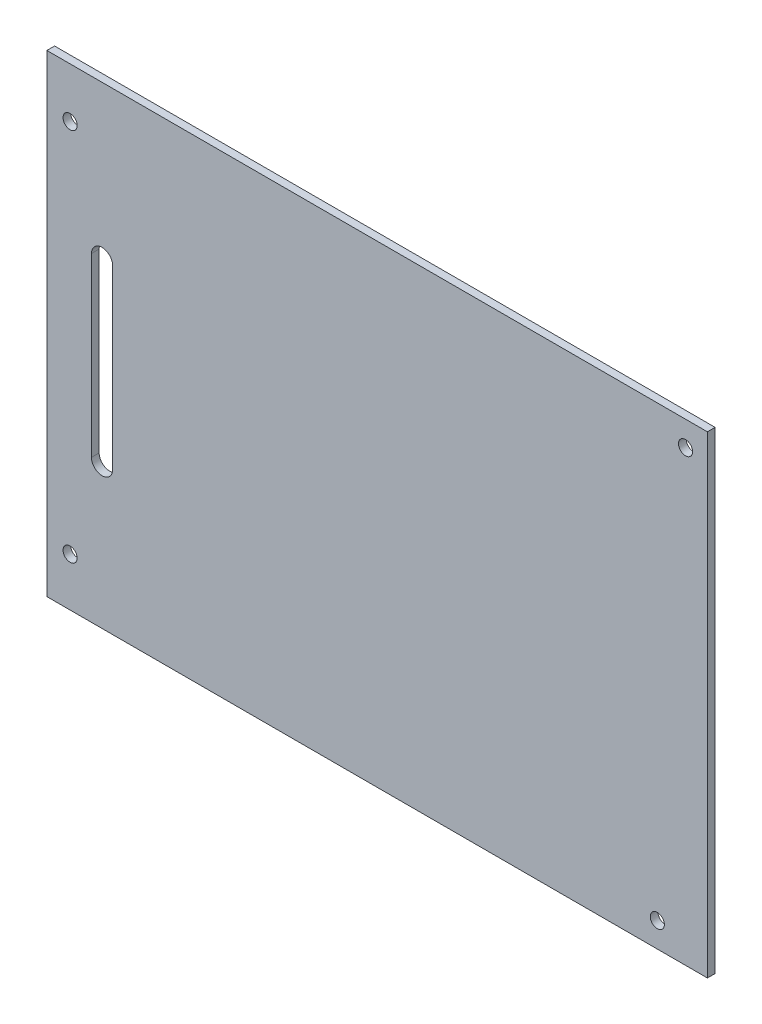
ISO-10303-21;
HEADER;
FILE_DESCRIPTION(('STEP AP214'),'2;1');
FILE_NAME('part.step','',(''),(''),'','','');
FILE_SCHEMA(('AUTOMOTIVE_DESIGN { 1 0 10303 214 1 1 1 1 }'));
ENDSEC;
DATA;
#1=APPLICATION_CONTEXT('core data for automotive mechanical design processes');
#2=APPLICATION_PROTOCOL_DEFINITION('international standard','automotive_design',2000,#1);
#3=PRODUCT_CONTEXT('',#1,'mechanical');
#4=PRODUCT('Part','Part','',(#3));
#5=PRODUCT_RELATED_PRODUCT_CATEGORY('part','',(#4));
#6=PRODUCT_DEFINITION_FORMATION('','',#4);
#7=PRODUCT_DEFINITION_CONTEXT('part definition',#1,'design');
#8=PRODUCT_DEFINITION('design','',#6,#7);
#9=PRODUCT_DEFINITION_SHAPE('','',#8);
#10=(LENGTH_UNIT() NAMED_UNIT(*) SI_UNIT(.MILLI.,.METRE.));
#11=(NAMED_UNIT(*) PLANE_ANGLE_UNIT() SI_UNIT($,.RADIAN.));
#12=(NAMED_UNIT(*) SI_UNIT($,.STERADIAN.) SOLID_ANGLE_UNIT());
#13=UNCERTAINTY_MEASURE_WITH_UNIT(LENGTH_MEASURE(1.E-05),#10,'distance_accuracy_value','');
#14=(GEOMETRIC_REPRESENTATION_CONTEXT(3) GLOBAL_UNCERTAINTY_ASSIGNED_CONTEXT((#13)) GLOBAL_UNIT_ASSIGNED_CONTEXT((#10,
#11,#12)) REPRESENTATION_CONTEXT('',''));
#15=CARTESIAN_POINT('',(0.,0.,0.));
#16=DIRECTION('',(0.,0.,1.));
#17=DIRECTION('',(1.,0.,0.));
#18=AXIS2_PLACEMENT_3D('',#15,#16,#17);
#19=CARTESIAN_POINT('',(102.6585,80.9275,1.09144054));
#20=DIRECTION('',(0.,0.,-1.));
#21=DIRECTION('',(0.,-1.,0.));
#22=AXIS2_PLACEMENT_3D('',#19,#20,#21);
#23=PLANE('',#22);
#24=CARTESIAN_POINT('',(146.336,110.928,1.09144054));
#25=DIRECTION('',(0.,0.,1.));
#26=DIRECTION('',(1.,0.,0.));
#27=AXIS2_PLACEMENT_3D('',#24,#25,#26);
#28=CIRCLE('',#27,1.);
#29=CARTESIAN_POINT('',(147.336,110.928,1.09144054));
#30=VERTEX_POINT('',#29);
#31=EDGE_CURVE('E26',#30,#30,#28,.T.);
#32=ORIENTED_EDGE('',*,*,#31,.F.);
#33=EDGE_LOOP('',(#32));
#34=FACE_BOUND('',#33,.T.);
#35=CARTESIAN_POINT('',(63.6999996,92.67500134,1.09144054));
#36=DIRECTION('',(0.,0.,1.));
#37=DIRECTION('',(1.,0.,0.));
#38=AXIS2_PLACEMENT_3D('',#35,#36,#37);
#39=CIRCLE('',#38,1.49999954);
#40=CARTESIAN_POINT('',(65.19999914,92.67500134,1.09144054));
#41=VERTEX_POINT('',#40);
#42=CARTESIAN_POINT('',(62.20000006,92.67500134,1.09144054));
#43=VERTEX_POINT('',#42);
#44=EDGE_CURVE('E48',#41,#43,#39,.T.);
#45=ORIENTED_EDGE('',*,*,#44,.F.);
#46=DIRECTION('',(0.,1.,0.));
#47=VECTOR('',#46,1.);
#48=CARTESIAN_POINT('',(65.19999914,67.67500054,1.09144054));
#49=LINE('',#48,#47);
#50=CARTESIAN_POINT('',(65.19999914,67.67500054,1.09144054));
#51=VERTEX_POINT('',#50);
#52=EDGE_CURVE('E186',#51,#41,#49,.T.);
#53=ORIENTED_EDGE('',*,*,#52,.F.);
#54=CARTESIAN_POINT('',(63.6999996,67.67500054,1.09144054));
#55=DIRECTION('',(0.,0.,1.));
#56=DIRECTION('',(-1.,0.,0.));
#57=AXIS2_PLACEMENT_3D('',#54,#55,#56);
#58=CIRCLE('',#57,1.49999954);
#59=CARTESIAN_POINT('',(62.20000006,67.67500054,1.09144054));
#60=VERTEX_POINT('',#59);
#61=EDGE_CURVE('E210',#60,#51,#58,.T.);
#62=ORIENTED_EDGE('',*,*,#61,.F.);
#63=DIRECTION('',(0.,-1.,0.));
#64=VECTOR('',#63,1.);
#65=CARTESIAN_POINT('',(62.20000006,92.67500134,1.09144054));
#66=LINE('',#65,#64);
#67=EDGE_CURVE('E198',#43,#60,#66,.T.);
#68=ORIENTED_EDGE('',*,*,#67,.F.);
#69=EDGE_LOOP('',(#45,#53,#62,#68));
#70=FACE_BOUND('',#69,.T.);
#71=CARTESIAN_POINT('',(142.336,50.928,1.09144054));
#72=DIRECTION('',(0.,0.,1.));
#73=DIRECTION('',(1.,0.,0.));
#74=AXIS2_PLACEMENT_3D('',#71,#72,#73);
#75=CIRCLE('',#74,1.);
#76=CARTESIAN_POINT('',(143.336,50.928,1.09144054));
#77=VERTEX_POINT('',#76);
#78=EDGE_CURVE('E182',#77,#77,#75,.T.);
#79=ORIENTED_EDGE('',*,*,#78,.F.);
#80=EDGE_LOOP('',(#79));
#81=FACE_BOUND('',#80,.T.);
#82=CARTESIAN_POINT('',(59.175,107.337,1.09144054));
#83=DIRECTION('',(0.,0.,1.));
#84=DIRECTION('',(1.,0.,0.));
#85=AXIS2_PLACEMENT_3D('',#82,#83,#84);
#86=CIRCLE('',#85,1.);
#87=CARTESIAN_POINT('',(60.175,107.337,1.09144054));
#88=VERTEX_POINT('',#87);
#89=EDGE_CURVE('E174',#88,#88,#86,.T.);
#90=ORIENTED_EDGE('',*,*,#89,.F.);
#91=EDGE_LOOP('',(#90));
#92=FACE_BOUND('',#91,.T.);
#93=CARTESIAN_POINT('',(59.174,54.289,1.09144054));
#94=DIRECTION('',(0.,0.,1.));
#95=DIRECTION('',(1.,0.,0.));
#96=AXIS2_PLACEMENT_3D('',#93,#94,#95);
#97=CIRCLE('',#96,1.);
#98=CARTESIAN_POINT('',(60.174,54.289,1.09144054));
#99=VERTEX_POINT('',#98);
#100=EDGE_CURVE('E117',#99,#99,#97,.T.);
#101=ORIENTED_EDGE('',*,*,#100,.F.);
#102=EDGE_LOOP('',(#101));
#103=FACE_BOUND('',#102,.T.);
#104=DIRECTION('',(-1.,0.,0.));
#105=VECTOR('',#104,1.);
#106=CARTESIAN_POINT('',(149.431,47.432,1.09144054));
#107=LINE('',#106,#105);
#108=CARTESIAN_POINT('',(149.431,47.432,1.09144054));
#109=VERTEX_POINT('',#108);
#110=CARTESIAN_POINT('',(55.886,47.432,1.09144054));
#111=VERTEX_POINT('',#110);
#112=EDGE_CURVE('E118',#109,#111,#107,.T.);
#113=ORIENTED_EDGE('',*,*,#112,.F.);
#114=DIRECTION('',(0.,-1.,0.));
#115=VECTOR('',#114,1.);
#116=CARTESIAN_POINT('',(149.431,114.423,1.09144054));
#117=LINE('',#116,#115);
#118=CARTESIAN_POINT('',(149.431,114.423,1.09144054));
#119=VERTEX_POINT('',#118);
#120=EDGE_CURVE('E143',#119,#109,#117,.T.);
#121=ORIENTED_EDGE('',*,*,#120,.F.);
#122=DIRECTION('',(1.,0.,0.));
#123=VECTOR('',#122,1.);
#124=CARTESIAN_POINT('',(55.886,114.423,1.09144054));
#125=LINE('',#124,#123);
#126=CARTESIAN_POINT('',(55.886,114.423,1.09144054));
#127=VERTEX_POINT('',#126);
#128=EDGE_CURVE('E128',#127,#119,#125,.T.);
#129=ORIENTED_EDGE('',*,*,#128,.F.);
#130=DIRECTION('',(0.,1.,0.));
#131=VECTOR('',#130,1.);
#132=CARTESIAN_POINT('',(55.886,47.432,1.09144054));
#133=LINE('',#132,#131);
#134=EDGE_CURVE('E133',#111,#127,#133,.T.);
#135=ORIENTED_EDGE('',*,*,#134,.F.);
#136=EDGE_LOOP('',(#113,#121,#129,#135));
#137=FACE_BOUND('',#136,.T.);
#138=ADVANCED_FACE('F17',(#34,#70,#81,#92,#103,#137),#23,.F.);
#139=CARTESIAN_POINT('',(102.6585,80.9275,0.));
#140=DIRECTION('',(0.,0.,-1.));
#141=DIRECTION('',(0.,-1.,0.));
#142=AXIS2_PLACEMENT_3D('',#139,#140,#141);
#143=PLANE('',#142);
#144=CARTESIAN_POINT('',(146.336,110.928,0.));
#145=DIRECTION('',(0.,0.,1.));
#146=DIRECTION('',(1.,0.,0.));
#147=AXIS2_PLACEMENT_3D('',#144,#145,#146);
#148=CIRCLE('',#147,1.);
#149=CARTESIAN_POINT('',(147.336,110.928,0.));
#150=VERTEX_POINT('',#149);
#151=EDGE_CURVE('E11',#150,#150,#148,.T.);
#152=ORIENTED_EDGE('',*,*,#151,.T.);
#153=EDGE_LOOP('',(#152));
#154=FACE_BOUND('',#153,.T.);
#155=DIRECTION('',(0.,-1.,0.));
#156=VECTOR('',#155,1.);
#157=CARTESIAN_POINT('',(62.20000006,92.67500134,0.));
#158=LINE('',#157,#156);
#159=CARTESIAN_POINT('',(62.20000006,92.67500134,0.));
#160=VERTEX_POINT('',#159);
#161=CARTESIAN_POINT('',(62.20000006,67.67500054,0.));
#162=VERTEX_POINT('',#161);
#163=EDGE_CURVE('E206',#160,#162,#158,.T.);
#164=ORIENTED_EDGE('',*,*,#163,.T.);
#165=CARTESIAN_POINT('',(63.6999996,67.67500054,0.));
#166=DIRECTION('',(0.,0.,1.));
#167=DIRECTION('',(-1.,0.,0.));
#168=AXIS2_PLACEMENT_3D('',#165,#166,#167);
#169=CIRCLE('',#168,1.49999954);
#170=CARTESIAN_POINT('',(65.19999914,67.67500054,0.));
#171=VERTEX_POINT('',#170);
#172=EDGE_CURVE('E218',#162,#171,#169,.T.);
#173=ORIENTED_EDGE('',*,*,#172,.T.);
#174=DIRECTION('',(0.,1.,0.));
#175=VECTOR('',#174,1.);
#176=CARTESIAN_POINT('',(65.19999914,67.67500054,0.));
#177=LINE('',#176,#175);
#178=CARTESIAN_POINT('',(65.19999914,92.67500134,0.));
#179=VERTEX_POINT('',#178);
#180=EDGE_CURVE('E165',#171,#179,#177,.T.);
#181=ORIENTED_EDGE('',*,*,#180,.T.);
#182=CARTESIAN_POINT('',(63.6999996,92.67500134,0.));
#183=DIRECTION('',(0.,0.,1.));
#184=DIRECTION('',(1.,0.,0.));
#185=AXIS2_PLACEMENT_3D('',#182,#183,#184);
#186=CIRCLE('',#185,1.49999954);
#187=EDGE_CURVE('E38',#179,#160,#186,.T.);
#188=ORIENTED_EDGE('',*,*,#187,.T.);
#189=EDGE_LOOP('',(#164,#173,#181,#188));
#190=FACE_BOUND('',#189,.T.);
#191=CARTESIAN_POINT('',(142.336,50.928,0.));
#192=DIRECTION('',(0.,0.,1.));
#193=DIRECTION('',(1.,0.,0.));
#194=AXIS2_PLACEMENT_3D('',#191,#192,#193);
#195=CIRCLE('',#194,1.);
#196=CARTESIAN_POINT('',(143.336,50.928,0.));
#197=VERTEX_POINT('',#196);
#198=EDGE_CURVE('E190',#197,#197,#195,.T.);
#199=ORIENTED_EDGE('',*,*,#198,.T.);
#200=EDGE_LOOP('',(#199));
#201=FACE_BOUND('',#200,.T.);
#202=CARTESIAN_POINT('',(59.175,107.337,0.));
#203=DIRECTION('',(0.,0.,1.));
#204=DIRECTION('',(1.,0.,0.));
#205=AXIS2_PLACEMENT_3D('',#202,#203,#204);
#206=CIRCLE('',#205,1.);
#207=CARTESIAN_POINT('',(60.175,107.337,0.));
#208=VERTEX_POINT('',#207);
#209=EDGE_CURVE('E178',#208,#208,#206,.T.);
#210=ORIENTED_EDGE('',*,*,#209,.T.);
#211=EDGE_LOOP('',(#210));
#212=FACE_BOUND('',#211,.T.);
#213=CARTESIAN_POINT('',(59.174,54.289,0.));
#214=DIRECTION('',(0.,0.,1.));
#215=DIRECTION('',(1.,0.,0.));
#216=AXIS2_PLACEMENT_3D('',#213,#214,#215);
#217=CIRCLE('',#216,1.);
#218=CARTESIAN_POINT('',(60.174,54.289,0.));
#219=VERTEX_POINT('',#218);
#220=EDGE_CURVE('E170',#219,#219,#217,.T.);
#221=ORIENTED_EDGE('',*,*,#220,.T.);
#222=EDGE_LOOP('',(#221));
#223=FACE_BOUND('',#222,.T.);
#224=DIRECTION('',(0.,1.,0.));
#225=VECTOR('',#224,1.);
#226=CARTESIAN_POINT('',(55.886,47.432,0.));
#227=LINE('',#226,#225);
#228=CARTESIAN_POINT('',(55.886,47.432,0.));
#229=VERTEX_POINT('',#228);
#230=CARTESIAN_POINT('',(55.886,114.423,0.));
#231=VERTEX_POINT('',#230);
#232=EDGE_CURVE('E109',#229,#231,#227,.T.);
#233=ORIENTED_EDGE('',*,*,#232,.T.);
#234=DIRECTION('',(1.,0.,0.));
#235=VECTOR('',#234,1.);
#236=CARTESIAN_POINT('',(55.886,114.423,0.));
#237=LINE('',#236,#235);
#238=CARTESIAN_POINT('',(149.431,114.423,0.));
#239=VERTEX_POINT('',#238);
#240=EDGE_CURVE('E148',#231,#239,#237,.T.);
#241=ORIENTED_EDGE('',*,*,#240,.T.);
#242=DIRECTION('',(0.,-1.,0.));
#243=VECTOR('',#242,1.);
#244=CARTESIAN_POINT('',(149.431,114.423,0.));
#245=LINE('',#244,#243);
#246=CARTESIAN_POINT('',(149.431,47.432,0.));
#247=VERTEX_POINT('',#246);
#248=EDGE_CURVE('E111',#239,#247,#245,.T.);
#249=ORIENTED_EDGE('',*,*,#248,.T.);
#250=DIRECTION('',(-1.,0.,0.));
#251=VECTOR('',#250,1.);
#252=CARTESIAN_POINT('',(149.431,47.432,0.));
#253=LINE('',#252,#251);
#254=EDGE_CURVE('E105',#247,#229,#253,.T.);
#255=ORIENTED_EDGE('',*,*,#254,.T.);
#256=EDGE_LOOP('',(#233,#241,#249,#255));
#257=FACE_BOUND('',#256,.T.);
#258=ADVANCED_FACE('F107',(#154,#190,#201,#212,#223,#257),#143,.T.);
#259=CARTESIAN_POINT('',(146.336,110.928,0.));
#260=DIRECTION('',(0.,0.,-1.));
#261=DIRECTION('',(1.,0.,0.));
#262=AXIS2_PLACEMENT_3D('',#259,#260,#261);
#263=CYLINDRICAL_SURFACE('',#262,1.);
#264=ORIENTED_EDGE('',*,*,#31,.T.);
#265=EDGE_LOOP('',(#264));
#266=FACE_BOUND('',#265,.T.);
#267=ORIENTED_EDGE('',*,*,#151,.F.);
#268=EDGE_LOOP('',(#267));
#269=FACE_BOUND('',#268,.T.);
#270=ADVANCED_FACE('F234',(#266,#269),#263,.F.);
#271=CARTESIAN_POINT('',(63.6999996,92.67500134,0.));
#272=DIRECTION('',(0.,0.,-1.));
#273=DIRECTION('',(1.,0.,0.));
#274=AXIS2_PLACEMENT_3D('',#271,#272,#273);
#275=CYLINDRICAL_SURFACE('',#274,1.49999954);
#276=DIRECTION('',(0.,0.,1.));
#277=VECTOR('',#276,1.);
#278=CARTESIAN_POINT('',(65.19999914,92.67500134,0.));
#279=LINE('',#278,#277);
#280=EDGE_CURVE('E183',#179,#41,#279,.T.);
#281=ORIENTED_EDGE('',*,*,#280,.T.);
#282=ORIENTED_EDGE('',*,*,#44,.T.);
#283=DIRECTION('',(0.,0.,1.));
#284=VECTOR('',#283,1.);
#285=CARTESIAN_POINT('',(62.20000006,92.67500134,0.));
#286=LINE('',#285,#284);
#287=EDGE_CURVE('E194',#160,#43,#286,.T.);
#288=ORIENTED_EDGE('',*,*,#287,.F.);
#289=ORIENTED_EDGE('',*,*,#187,.F.);
#290=EDGE_LOOP('',(#281,#282,#288,#289));
#291=FACE_BOUND('',#290,.T.);
#292=ADVANCED_FACE('F273',(#291),#275,.F.);
#293=CARTESIAN_POINT('',(65.19999914,67.67500054,0.));
#294=DIRECTION('',(-1.,0.,0.));
#295=DIRECTION('',(0.,0.,1.));
#296=AXIS2_PLACEMENT_3D('',#293,#294,#295);
#297=PLANE('',#296);
#298=DIRECTION('',(0.,0.,1.));
#299=VECTOR('',#298,1.);
#300=CARTESIAN_POINT('',(65.19999914,67.67500054,0.));
#301=LINE('',#300,#299);
#302=EDGE_CURVE('E214',#171,#51,#301,.T.);
#303=ORIENTED_EDGE('',*,*,#302,.T.);
#304=ORIENTED_EDGE('',*,*,#52,.T.);
#305=ORIENTED_EDGE('',*,*,#280,.F.);
#306=ORIENTED_EDGE('',*,*,#180,.F.);
#307=EDGE_LOOP('',(#303,#304,#305,#306));
#308=FACE_BOUND('',#307,.T.);
#309=ADVANCED_FACE('F19',(#308),#297,.T.);
#310=CARTESIAN_POINT('',(63.6999996,67.67500054,0.));
#311=DIRECTION('',(0.,0.,-1.));
#312=DIRECTION('',(-1.,0.,0.));
#313=AXIS2_PLACEMENT_3D('',#310,#311,#312);
#314=CYLINDRICAL_SURFACE('',#313,1.49999954);
#315=DIRECTION('',(0.,0.,1.));
#316=VECTOR('',#315,1.);
#317=CARTESIAN_POINT('',(62.20000006,67.67500054,0.));
#318=LINE('',#317,#316);
#319=EDGE_CURVE('E202',#162,#60,#318,.T.);
#320=ORIENTED_EDGE('',*,*,#319,.T.);
#321=ORIENTED_EDGE('',*,*,#61,.T.);
#322=ORIENTED_EDGE('',*,*,#302,.F.);
#323=ORIENTED_EDGE('',*,*,#172,.F.);
#324=EDGE_LOOP('',(#320,#321,#322,#323));
#325=FACE_BOUND('',#324,.T.);
#326=ADVANCED_FACE('F280',(#325),#314,.F.);
#327=CARTESIAN_POINT('',(62.20000006,92.67500134,0.));
#328=DIRECTION('',(1.,0.,0.));
#329=DIRECTION('',(0.,-1.,0.));
#330=AXIS2_PLACEMENT_3D('',#327,#328,#329);
#331=PLANE('',#330);
#332=ORIENTED_EDGE('',*,*,#287,.T.);
#333=ORIENTED_EDGE('',*,*,#67,.T.);
#334=ORIENTED_EDGE('',*,*,#319,.F.);
#335=ORIENTED_EDGE('',*,*,#163,.F.);
#336=EDGE_LOOP('',(#332,#333,#334,#335));
#337=FACE_BOUND('',#336,.T.);
#338=ADVANCED_FACE('F276',(#337),#331,.T.);
#339=CARTESIAN_POINT('',(142.336,50.928,0.));
#340=DIRECTION('',(0.,0.,-1.));
#341=DIRECTION('',(1.,0.,0.));
#342=AXIS2_PLACEMENT_3D('',#339,#340,#341);
#343=CYLINDRICAL_SURFACE('',#342,1.);
#344=ORIENTED_EDGE('',*,*,#78,.T.);
#345=EDGE_LOOP('',(#344));
#346=FACE_BOUND('',#345,.T.);
#347=ORIENTED_EDGE('',*,*,#198,.F.);
#348=EDGE_LOOP('',(#347));
#349=FACE_BOUND('',#348,.T.);
#350=ADVANCED_FACE('F269',(#346,#349),#343,.F.);
#351=CARTESIAN_POINT('',(59.175,107.337,0.));
#352=DIRECTION('',(0.,0.,-1.));
#353=DIRECTION('',(1.,0.,0.));
#354=AXIS2_PLACEMENT_3D('',#351,#352,#353);
#355=CYLINDRICAL_SURFACE('',#354,1.);
#356=ORIENTED_EDGE('',*,*,#89,.T.);
#357=EDGE_LOOP('',(#356));
#358=FACE_BOUND('',#357,.T.);
#359=ORIENTED_EDGE('',*,*,#209,.F.);
#360=EDGE_LOOP('',(#359));
#361=FACE_BOUND('',#360,.T.);
#362=ADVANCED_FACE('F265',(#358,#361),#355,.F.);
#363=CARTESIAN_POINT('',(59.174,54.289,0.));
#364=DIRECTION('',(0.,0.,-1.));
#365=DIRECTION('',(1.,0.,0.));
#366=AXIS2_PLACEMENT_3D('',#363,#364,#365);
#367=CYLINDRICAL_SURFACE('',#366,1.);
#368=ORIENTED_EDGE('',*,*,#100,.T.);
#369=EDGE_LOOP('',(#368));
#370=FACE_BOUND('',#369,.T.);
#371=ORIENTED_EDGE('',*,*,#220,.F.);
#372=EDGE_LOOP('',(#371));
#373=FACE_BOUND('',#372,.T.);
#374=ADVANCED_FACE('F262',(#370,#373),#367,.F.);
#375=CARTESIAN_POINT('',(149.431,47.432,0.));
#376=DIRECTION('',(0.,-1.,0.));
#377=DIRECTION('',(0.,0.,-1.));
#378=AXIS2_PLACEMENT_3D('',#375,#376,#377);
#379=PLANE('',#378);
#380=DIRECTION('',(0.,0.,1.));
#381=VECTOR('',#380,1.);
#382=CARTESIAN_POINT('',(149.431,47.432,0.));
#383=LINE('',#382,#381);
#384=EDGE_CURVE('E147',#247,#109,#383,.T.);
#385=ORIENTED_EDGE('',*,*,#384,.T.);
#386=ORIENTED_EDGE('',*,*,#112,.T.);
#387=DIRECTION('',(0.,0.,1.));
#388=VECTOR('',#387,1.);
#389=CARTESIAN_POINT('',(55.886,47.432,0.));
#390=LINE('',#389,#388);
#391=EDGE_CURVE('E124',#229,#111,#390,.T.);
#392=ORIENTED_EDGE('',*,*,#391,.F.);
#393=ORIENTED_EDGE('',*,*,#254,.F.);
#394=EDGE_LOOP('',(#385,#386,#392,#393));
#395=FACE_BOUND('',#394,.T.);
#396=ADVANCED_FACE('F130',(#395),#379,.T.);
#397=CARTESIAN_POINT('',(149.431,114.423,0.));
#398=DIRECTION('',(1.,0.,0.));
#399=DIRECTION('',(0.,1.,0.));
#400=AXIS2_PLACEMENT_3D('',#397,#398,#399);
#401=PLANE('',#400);
#402=DIRECTION('',(0.,0.,1.));
#403=VECTOR('',#402,1.);
#404=CARTESIAN_POINT('',(149.431,114.423,0.));
#405=LINE('',#404,#403);
#406=EDGE_CURVE('E152',#239,#119,#405,.T.);
#407=ORIENTED_EDGE('',*,*,#406,.T.);
#408=ORIENTED_EDGE('',*,*,#120,.T.);
#409=ORIENTED_EDGE('',*,*,#384,.F.);
#410=ORIENTED_EDGE('',*,*,#248,.F.);
#411=EDGE_LOOP('',(#407,#408,#409,#410));
#412=FACE_BOUND('',#411,.T.);
#413=ADVANCED_FACE('F247',(#412),#401,.T.);
#414=CARTESIAN_POINT('',(55.886,114.423,0.));
#415=DIRECTION('',(0.,1.,0.));
#416=DIRECTION('',(1.,0.,0.));
#417=AXIS2_PLACEMENT_3D('',#414,#415,#416);
#418=PLANE('',#417);
#419=DIRECTION('',(0.,0.,1.));
#420=VECTOR('',#419,1.);
#421=CARTESIAN_POINT('',(55.886,114.423,0.));
#422=LINE('',#421,#420);
#423=EDGE_CURVE('E126',#231,#127,#422,.T.);
#424=ORIENTED_EDGE('',*,*,#423,.T.);
#425=ORIENTED_EDGE('',*,*,#128,.T.);
#426=ORIENTED_EDGE('',*,*,#406,.F.);
#427=ORIENTED_EDGE('',*,*,#240,.F.);
#428=EDGE_LOOP('',(#424,#425,#426,#427));
#429=FACE_BOUND('',#428,.T.);
#430=ADVANCED_FACE('F250',(#429),#418,.T.);
#431=CARTESIAN_POINT('',(55.886,47.432,0.));
#432=DIRECTION('',(-1.,0.,0.));
#433=DIRECTION('',(0.,0.,1.));
#434=AXIS2_PLACEMENT_3D('',#431,#432,#433);
#435=PLANE('',#434);
#436=ORIENTED_EDGE('',*,*,#391,.T.);
#437=ORIENTED_EDGE('',*,*,#134,.T.);
#438=ORIENTED_EDGE('',*,*,#423,.F.);
#439=ORIENTED_EDGE('',*,*,#232,.F.);
#440=EDGE_LOOP('',(#436,#437,#438,#439));
#441=FACE_BOUND('',#440,.T.);
#442=ADVANCED_FACE('F122',(#441),#435,.T.);
#443=CLOSED_SHELL('',(#138,#258,#270,#292,#309,#326,#338,#350,#362,#374,#396,#413,#430,#442));
#444=MANIFOLD_SOLID_BREP('B1',#443);
#445=ADVANCED_BREP_SHAPE_REPRESENTATION('',(#18,#444),#14);
#446=SHAPE_DEFINITION_REPRESENTATION(#9,#445);
ENDSEC;
END-ISO-10303-21;
